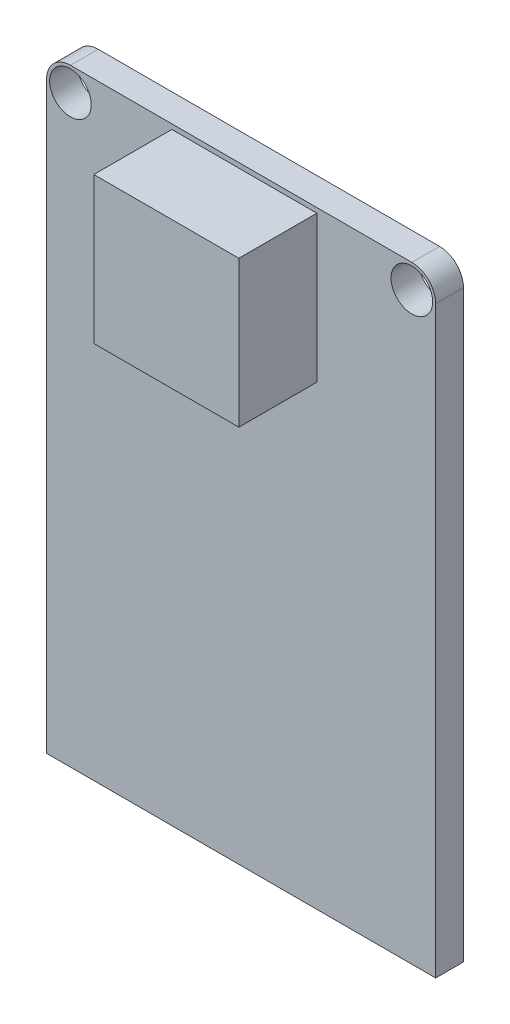
ISO-10303-21;
HEADER;
FILE_DESCRIPTION(('STEP AP214'),'2;1');
FILE_NAME('part.step','',(''),(''),'','','');
FILE_SCHEMA(('AUTOMOTIVE_DESIGN { 1 0 10303 214 1 1 1 1 }'));
ENDSEC;
DATA;
#1=APPLICATION_CONTEXT('core data for automotive mechanical design processes');
#2=APPLICATION_PROTOCOL_DEFINITION('international standard','automotive_design',2000,#1);
#3=PRODUCT_CONTEXT('',#1,'mechanical');
#4=PRODUCT('Part','Part','',(#3));
#5=PRODUCT_RELATED_PRODUCT_CATEGORY('part','',(#4));
#6=PRODUCT_DEFINITION_FORMATION('','',#4);
#7=PRODUCT_DEFINITION_CONTEXT('part definition',#1,'design');
#8=PRODUCT_DEFINITION('design','',#6,#7);
#9=PRODUCT_DEFINITION_SHAPE('','',#8);
#10=(LENGTH_UNIT() NAMED_UNIT(*) SI_UNIT(.MILLI.,.METRE.));
#11=(NAMED_UNIT(*) PLANE_ANGLE_UNIT() SI_UNIT($,.RADIAN.));
#12=(NAMED_UNIT(*) SI_UNIT($,.STERADIAN.) SOLID_ANGLE_UNIT());
#13=UNCERTAINTY_MEASURE_WITH_UNIT(LENGTH_MEASURE(1.E-05),#10,'distance_accuracy_value','');
#14=(GEOMETRIC_REPRESENTATION_CONTEXT(3) GLOBAL_UNCERTAINTY_ASSIGNED_CONTEXT((#13)) GLOBAL_UNIT_ASSIGNED_CONTEXT((#10,
#11,#12)) REPRESENTATION_CONTEXT('',''));
#15=CARTESIAN_POINT('',(0.,0.,0.));
#16=DIRECTION('',(0.,0.,1.));
#17=DIRECTION('',(1.,0.,0.));
#18=AXIS2_PLACEMENT_3D('',#15,#16,#17);
#19=CARTESIAN_POINT('',(-10.00125,16.4084,1.6256));
#20=DIRECTION('',(0.,0.,1.));
#21=DIRECTION('',(1.,0.,0.));
#22=AXIS2_PLACEMENT_3D('',#19,#20,#21);
#23=PLANE('',#22);
#24=CARTESIAN_POINT('',(-10.00125,16.4084,1.6256));
#25=DIRECTION('',(0.,0.,1.));
#26=DIRECTION('',(1.,0.,0.));
#27=AXIS2_PLACEMENT_3D('',#24,#25,#26);
#28=CIRCLE('',#27,1.21960350661836);
#29=CARTESIAN_POINT('',(-8.78164649338164,16.4084,1.6256));
#30=VERTEX_POINT('',#29);
#31=EDGE_CURVE('E140',#30,#30,#28,.T.);
#32=ORIENTED_EDGE('',*,*,#31,.F.);
#33=EDGE_LOOP('',(#32));
#34=FACE_BOUND('',#33,.T.);
#35=DIRECTION('',(0.,-1.,0.));
#36=VECTOR('',#35,1.);
#37=CARTESIAN_POINT('',(-11.39825,-17.8054,1.6256));
#38=LINE('',#37,#36);
#39=CARTESIAN_POINT('',(-11.39825,16.4084,1.6256));
#40=VERTEX_POINT('',#39);
#41=CARTESIAN_POINT('',(-11.39825,-17.8054,1.6256));
#42=VERTEX_POINT('',#41);
#43=EDGE_CURVE('E148',#40,#42,#38,.T.);
#44=ORIENTED_EDGE('',*,*,#43,.T.);
#45=DIRECTION('',(1.,0.,0.));
#46=VECTOR('',#45,1.);
#47=CARTESIAN_POINT('',(-11.39825,-17.8054,1.6256));
#48=LINE('',#47,#46);
#49=CARTESIAN_POINT('',(11.39825,-17.8054,1.6256));
#50=VERTEX_POINT('',#49);
#51=EDGE_CURVE('E98',#42,#50,#48,.T.);
#52=ORIENTED_EDGE('',*,*,#51,.T.);
#53=DIRECTION('',(0.,1.,0.));
#54=VECTOR('',#53,1.);
#55=CARTESIAN_POINT('',(11.39825,-17.8054,1.6256));
#56=LINE('',#55,#54);
#57=CARTESIAN_POINT('',(11.39825,16.4084,1.6256));
#58=VERTEX_POINT('',#57);
#59=EDGE_CURVE('E115',#50,#58,#56,.T.);
#60=ORIENTED_EDGE('',*,*,#59,.T.);
#61=CARTESIAN_POINT('',(10.00125,16.4084,1.6256));
#62=DIRECTION('',(0.,0.,1.));
#63=DIRECTION('',(1.,0.,0.));
#64=AXIS2_PLACEMENT_3D('',#61,#62,#63);
#65=CIRCLE('',#64,1.397);
#66=CARTESIAN_POINT('',(10.00125,17.8054,1.6256));
#67=VERTEX_POINT('',#66);
#68=EDGE_CURVE('E108',#58,#67,#65,.T.);
#69=ORIENTED_EDGE('',*,*,#68,.T.);
#70=DIRECTION('',(-1.,0.,0.));
#71=VECTOR('',#70,1.);
#72=CARTESIAN_POINT('',(-10.00125,17.8054,1.6256));
#73=LINE('',#72,#71);
#74=CARTESIAN_POINT('',(-10.00125,17.8054,1.6256));
#75=VERTEX_POINT('',#74);
#76=EDGE_CURVE('E112',#67,#75,#73,.T.);
#77=ORIENTED_EDGE('',*,*,#76,.T.);
#78=CARTESIAN_POINT('',(-10.00125,16.4084,1.6256));
#79=DIRECTION('',(0.,0.,1.));
#80=DIRECTION('',(1.,0.,0.));
#81=AXIS2_PLACEMENT_3D('',#78,#79,#80);
#82=CIRCLE('',#81,1.397);
#83=EDGE_CURVE('E63',#75,#40,#82,.T.);
#84=ORIENTED_EDGE('',*,*,#83,.T.);
#85=EDGE_LOOP('',(#44,#52,#60,#69,#77,#84));
#86=FACE_BOUND('',#85,.T.);
#87=CARTESIAN_POINT('',(10.00125,16.4084,1.6256));
#88=DIRECTION('',(0.,0.,1.));
#89=DIRECTION('',(1.,0.,0.));
#90=AXIS2_PLACEMENT_3D('',#87,#88,#89);
#91=CIRCLE('',#90,1.21960350661836);
#92=CARTESIAN_POINT('',(11.2208535066184,16.4084,1.6256));
#93=VERTEX_POINT('',#92);
#94=EDGE_CURVE('E169',#93,#93,#91,.T.);
#95=ORIENTED_EDGE('',*,*,#94,.F.);
#96=EDGE_LOOP('',(#95));
#97=FACE_BOUND('',#96,.T.);
#98=DIRECTION('',(-1.,0.,0.));
#99=VECTOR('',#98,1.);
#100=CARTESIAN_POINT('',(-4.05765,17.51965,1.6256));
#101=LINE('',#100,#99);
#102=CARTESIAN_POINT('',(4.43865,17.51965,1.6256));
#103=VERTEX_POINT('',#102);
#104=CARTESIAN_POINT('',(-4.05765,17.51965,1.6256));
#105=VERTEX_POINT('',#104);
#106=EDGE_CURVE('E193',#103,#105,#101,.T.);
#107=ORIENTED_EDGE('',*,*,#106,.F.);
#108=DIRECTION('',(0.,1.,0.));
#109=VECTOR('',#108,1.);
#110=CARTESIAN_POINT('',(4.43865,8.94715,1.6256));
#111=LINE('',#110,#109);
#112=CARTESIAN_POINT('',(4.43865,8.94715,1.6256));
#113=VERTEX_POINT('',#112);
#114=EDGE_CURVE('E196',#113,#103,#111,.T.);
#115=ORIENTED_EDGE('',*,*,#114,.F.);
#116=DIRECTION('',(1.,0.,0.));
#117=VECTOR('',#116,1.);
#118=CARTESIAN_POINT('',(-4.05765,8.94715,1.6256));
#119=LINE('',#118,#117);
#120=CARTESIAN_POINT('',(-4.05765,8.94715,1.6256));
#121=VERTEX_POINT('',#120);
#122=EDGE_CURVE('E188',#121,#113,#119,.T.);
#123=ORIENTED_EDGE('',*,*,#122,.F.);
#124=DIRECTION('',(0.,-1.,0.));
#125=VECTOR('',#124,1.);
#126=CARTESIAN_POINT('',(-4.05765,8.94715,1.6256));
#127=LINE('',#126,#125);
#128=EDGE_CURVE('E191',#105,#121,#127,.T.);
#129=ORIENTED_EDGE('',*,*,#128,.F.);
#130=EDGE_LOOP('',(#107,#115,#123,#129));
#131=FACE_BOUND('',#130,.T.);
#132=ADVANCED_FACE('F39',(#34,#86,#97,#131),#23,.T.);
#133=CARTESIAN_POINT('',(-10.00125,16.4084,0.));
#134=DIRECTION('',(0.,0.,1.));
#135=DIRECTION('',(1.,0.,0.));
#136=AXIS2_PLACEMENT_3D('',#133,#134,#135);
#137=PLANE('',#136);
#138=DIRECTION('',(0.,-1.,0.));
#139=VECTOR('',#138,1.);
#140=CARTESIAN_POINT('',(-11.39825,-17.8054,0.));
#141=LINE('',#140,#139);
#142=CARTESIAN_POINT('',(-11.39825,16.4084,0.));
#143=VERTEX_POINT('',#142);
#144=CARTESIAN_POINT('',(-11.39825,-17.8054,0.));
#145=VERTEX_POINT('',#144);
#146=EDGE_CURVE('E136',#143,#145,#141,.T.);
#147=ORIENTED_EDGE('',*,*,#146,.F.);
#148=CARTESIAN_POINT('',(-10.00125,16.4084,0.));
#149=DIRECTION('',(0.,0.,1.));
#150=DIRECTION('',(1.,0.,0.));
#151=AXIS2_PLACEMENT_3D('',#148,#149,#150);
#152=CIRCLE('',#151,1.397);
#153=CARTESIAN_POINT('',(-10.00125,17.8054,0.));
#154=VERTEX_POINT('',#153);
#155=EDGE_CURVE('E90',#154,#143,#152,.T.);
#156=ORIENTED_EDGE('',*,*,#155,.F.);
#157=DIRECTION('',(-1.,0.,0.));
#158=VECTOR('',#157,1.);
#159=CARTESIAN_POINT('',(-10.00125,17.8054,0.));
#160=LINE('',#159,#158);
#161=CARTESIAN_POINT('',(10.00125,17.8054,0.));
#162=VERTEX_POINT('',#161);
#163=EDGE_CURVE('E145',#162,#154,#160,.T.);
#164=ORIENTED_EDGE('',*,*,#163,.F.);
#165=CARTESIAN_POINT('',(10.00125,16.4084,0.));
#166=DIRECTION('',(0.,0.,1.));
#167=DIRECTION('',(1.,0.,0.));
#168=AXIS2_PLACEMENT_3D('',#165,#166,#167);
#169=CIRCLE('',#168,1.397);
#170=CARTESIAN_POINT('',(11.39825,16.4084,0.));
#171=VERTEX_POINT('',#170);
#172=EDGE_CURVE('E124',#171,#162,#169,.T.);
#173=ORIENTED_EDGE('',*,*,#172,.F.);
#174=DIRECTION('',(0.,1.,0.));
#175=VECTOR('',#174,1.);
#176=CARTESIAN_POINT('',(11.39825,-17.8054,0.));
#177=LINE('',#176,#175);
#178=CARTESIAN_POINT('',(11.39825,-17.8054,0.));
#179=VERTEX_POINT('',#178);
#180=EDGE_CURVE('E142',#179,#171,#177,.T.);
#181=ORIENTED_EDGE('',*,*,#180,.F.);
#182=DIRECTION('',(1.,0.,0.));
#183=VECTOR('',#182,1.);
#184=CARTESIAN_POINT('',(-11.39825,-17.8054,0.));
#185=LINE('',#184,#183);
#186=EDGE_CURVE('E139',#145,#179,#185,.T.);
#187=ORIENTED_EDGE('',*,*,#186,.F.);
#188=EDGE_LOOP('',(#147,#156,#164,#173,#181,#187));
#189=FACE_BOUND('',#188,.T.);
#190=CARTESIAN_POINT('',(-10.00125,16.4084,0.));
#191=DIRECTION('',(0.,0.,1.));
#192=DIRECTION('',(1.,0.,0.));
#193=AXIS2_PLACEMENT_3D('',#190,#191,#192);
#194=CIRCLE('',#193,1.21960350661836);
#195=CARTESIAN_POINT('',(-8.78164649338164,16.4084,0.));
#196=VERTEX_POINT('',#195);
#197=EDGE_CURVE('E166',#196,#196,#194,.T.);
#198=ORIENTED_EDGE('',*,*,#197,.T.);
#199=EDGE_LOOP('',(#198));
#200=FACE_BOUND('',#199,.T.);
#201=CARTESIAN_POINT('',(10.00125,16.4084,0.));
#202=DIRECTION('',(0.,0.,1.));
#203=DIRECTION('',(1.,0.,0.));
#204=AXIS2_PLACEMENT_3D('',#201,#202,#203);
#205=CIRCLE('',#204,1.21960350661836);
#206=CARTESIAN_POINT('',(11.2208535066184,16.4084,0.));
#207=VERTEX_POINT('',#206);
#208=EDGE_CURVE('E172',#207,#207,#205,.T.);
#209=ORIENTED_EDGE('',*,*,#208,.T.);
#210=EDGE_LOOP('',(#209));
#211=FACE_BOUND('',#210,.T.);
#212=ADVANCED_FACE('F157',(#189,#200,#211),#137,.F.);
#213=CARTESIAN_POINT('',(-11.39825,-17.8054,1.6256));
#214=DIRECTION('',(1.,0.,0.));
#215=DIRECTION('',(0.,0.,-1.));
#216=AXIS2_PLACEMENT_3D('',#213,#214,#215);
#217=PLANE('',#216);
#218=ORIENTED_EDGE('',*,*,#146,.T.);
#219=DIRECTION('',(0.,0.,-1.));
#220=VECTOR('',#219,1.);
#221=CARTESIAN_POINT('',(-11.39825,-17.8054,1.6256));
#222=LINE('',#221,#220);
#223=EDGE_CURVE('E11',#42,#145,#222,.T.);
#224=ORIENTED_EDGE('',*,*,#223,.F.);
#225=ORIENTED_EDGE('',*,*,#43,.F.);
#226=DIRECTION('',(0.,0.,-1.));
#227=VECTOR('',#226,1.);
#228=CARTESIAN_POINT('',(-11.39825,16.4084,1.6256));
#229=LINE('',#228,#227);
#230=EDGE_CURVE('E132',#40,#143,#229,.T.);
#231=ORIENTED_EDGE('',*,*,#230,.T.);
#232=EDGE_LOOP('',(#218,#224,#225,#231));
#233=FACE_BOUND('',#232,.T.);
#234=ADVANCED_FACE('F41',(#233),#217,.F.);
#235=CARTESIAN_POINT('',(-11.39825,-17.8054,1.6256));
#236=DIRECTION('',(0.,1.,0.));
#237=DIRECTION('',(0.,0.,1.));
#238=AXIS2_PLACEMENT_3D('',#235,#236,#237);
#239=PLANE('',#238);
#240=ORIENTED_EDGE('',*,*,#186,.T.);
#241=DIRECTION('',(0.,0.,-1.));
#242=VECTOR('',#241,1.);
#243=CARTESIAN_POINT('',(11.39825,-17.8054,1.6256));
#244=LINE('',#243,#242);
#245=EDGE_CURVE('E47',#50,#179,#244,.T.);
#246=ORIENTED_EDGE('',*,*,#245,.F.);
#247=ORIENTED_EDGE('',*,*,#51,.F.);
#248=ORIENTED_EDGE('',*,*,#223,.T.);
#249=EDGE_LOOP('',(#240,#246,#247,#248));
#250=FACE_BOUND('',#249,.T.);
#251=ADVANCED_FACE('F259',(#250),#239,.F.);
#252=CARTESIAN_POINT('',(11.39825,-17.8054,1.6256));
#253=DIRECTION('',(-1.,0.,0.));
#254=DIRECTION('',(0.,0.,1.));
#255=AXIS2_PLACEMENT_3D('',#252,#253,#254);
#256=PLANE('',#255);
#257=ORIENTED_EDGE('',*,*,#180,.T.);
#258=DIRECTION('',(0.,0.,-1.));
#259=VECTOR('',#258,1.);
#260=CARTESIAN_POINT('',(11.39825,16.4084,1.6256));
#261=LINE('',#260,#259);
#262=EDGE_CURVE('E127',#58,#171,#261,.T.);
#263=ORIENTED_EDGE('',*,*,#262,.F.);
#264=ORIENTED_EDGE('',*,*,#59,.F.);
#265=ORIENTED_EDGE('',*,*,#245,.T.);
#266=EDGE_LOOP('',(#257,#263,#264,#265));
#267=FACE_BOUND('',#266,.T.);
#268=ADVANCED_FACE('F154',(#267),#256,.F.);
#269=CARTESIAN_POINT('',(10.00125,16.4084,1.6256));
#270=DIRECTION('',(0.,0.,-1.));
#271=DIRECTION('',(-1.,0.,0.));
#272=AXIS2_PLACEMENT_3D('',#269,#270,#271);
#273=CYLINDRICAL_SURFACE('',#272,1.397);
#274=ORIENTED_EDGE('',*,*,#172,.T.);
#275=DIRECTION('',(0.,0.,-1.));
#276=VECTOR('',#275,1.);
#277=CARTESIAN_POINT('',(10.00125,17.8054,1.6256));
#278=LINE('',#277,#276);
#279=EDGE_CURVE('E121',#67,#162,#278,.T.);
#280=ORIENTED_EDGE('',*,*,#279,.F.);
#281=ORIENTED_EDGE('',*,*,#68,.F.);
#282=ORIENTED_EDGE('',*,*,#262,.T.);
#283=EDGE_LOOP('',(#274,#280,#281,#282));
#284=FACE_BOUND('',#283,.T.);
#285=ADVANCED_FACE('F122',(#284),#273,.T.);
#286=CARTESIAN_POINT('',(-10.00125,17.8054,1.6256));
#287=DIRECTION('',(0.,-1.,0.));
#288=DIRECTION('',(0.,0.,-1.));
#289=AXIS2_PLACEMENT_3D('',#286,#287,#288);
#290=PLANE('',#289);
#291=ORIENTED_EDGE('',*,*,#163,.T.);
#292=DIRECTION('',(0.,0.,-1.));
#293=VECTOR('',#292,1.);
#294=CARTESIAN_POINT('',(-10.00125,17.8054,1.6256));
#295=LINE('',#294,#293);
#296=EDGE_CURVE('E128',#75,#154,#295,.T.);
#297=ORIENTED_EDGE('',*,*,#296,.F.);
#298=ORIENTED_EDGE('',*,*,#76,.F.);
#299=ORIENTED_EDGE('',*,*,#279,.T.);
#300=EDGE_LOOP('',(#291,#297,#298,#299));
#301=FACE_BOUND('',#300,.T.);
#302=ADVANCED_FACE('F130',(#301),#290,.F.);
#303=CARTESIAN_POINT('',(-10.00125,16.4084,1.6256));
#304=DIRECTION('',(0.,0.,-1.));
#305=DIRECTION('',(-1.,0.,0.));
#306=AXIS2_PLACEMENT_3D('',#303,#304,#305);
#307=CYLINDRICAL_SURFACE('',#306,1.397);
#308=ORIENTED_EDGE('',*,*,#155,.T.);
#309=ORIENTED_EDGE('',*,*,#230,.F.);
#310=ORIENTED_EDGE('',*,*,#83,.F.);
#311=ORIENTED_EDGE('',*,*,#296,.T.);
#312=EDGE_LOOP('',(#308,#309,#310,#311));
#313=FACE_BOUND('',#312,.T.);
#314=ADVANCED_FACE('F159',(#313),#307,.T.);
#315=CARTESIAN_POINT('',(-10.00125,16.4084,1.6256));
#316=DIRECTION('',(0.,0.,-1.));
#317=DIRECTION('',(-1.,0.,0.));
#318=AXIS2_PLACEMENT_3D('',#315,#316,#317);
#319=CYLINDRICAL_SURFACE('',#318,1.21960350661836);
#320=ORIENTED_EDGE('',*,*,#31,.T.);
#321=EDGE_LOOP('',(#320));
#322=FACE_BOUND('',#321,.T.);
#323=ORIENTED_EDGE('',*,*,#197,.F.);
#324=EDGE_LOOP('',(#323));
#325=FACE_BOUND('',#324,.T.);
#326=ADVANCED_FACE('F249',(#322,#325),#319,.F.);
#327=CARTESIAN_POINT('',(10.00125,16.4084,1.6256));
#328=DIRECTION('',(0.,0.,-1.));
#329=DIRECTION('',(-1.,0.,0.));
#330=AXIS2_PLACEMENT_3D('',#327,#328,#329);
#331=CYLINDRICAL_SURFACE('',#330,1.21960350661836);
#332=ORIENTED_EDGE('',*,*,#94,.T.);
#333=EDGE_LOOP('',(#332));
#334=FACE_BOUND('',#333,.T.);
#335=ORIENTED_EDGE('',*,*,#208,.F.);
#336=EDGE_LOOP('',(#335));
#337=FACE_BOUND('',#336,.T.);
#338=ADVANCED_FACE('F305',(#334,#337),#331,.F.);
#339=CARTESIAN_POINT('',(4.43865,8.94715,6.1976));
#340=DIRECTION('',(-1.,0.,0.));
#341=DIRECTION('',(0.,0.,1.));
#342=AXIS2_PLACEMENT_3D('',#339,#340,#341);
#343=PLANE('',#342);
#344=ORIENTED_EDGE('',*,*,#114,.T.);
#345=DIRECTION('',(0.,0.,-1.));
#346=VECTOR('',#345,1.);
#347=CARTESIAN_POINT('',(4.43865,17.51965,6.1976));
#348=LINE('',#347,#346);
#349=CARTESIAN_POINT('',(4.43865,17.51965,6.1976));
#350=VERTEX_POINT('',#349);
#351=EDGE_CURVE('E175',#350,#103,#348,.T.);
#352=ORIENTED_EDGE('',*,*,#351,.F.);
#353=DIRECTION('',(0.,1.,0.));
#354=VECTOR('',#353,1.);
#355=CARTESIAN_POINT('',(4.43865,8.94715,6.1976));
#356=LINE('',#355,#354);
#357=CARTESIAN_POINT('',(4.43865,8.94715,6.1976));
#358=VERTEX_POINT('',#357);
#359=EDGE_CURVE('E190',#358,#350,#356,.T.);
#360=ORIENTED_EDGE('',*,*,#359,.F.);
#361=DIRECTION('',(0.,0.,-1.));
#362=VECTOR('',#361,1.);
#363=CARTESIAN_POINT('',(4.43865,8.94715,6.1976));
#364=LINE('',#363,#362);
#365=EDGE_CURVE('E184',#358,#113,#364,.T.);
#366=ORIENTED_EDGE('',*,*,#365,.T.);
#367=EDGE_LOOP('',(#344,#352,#360,#366));
#368=FACE_BOUND('',#367,.T.);
#369=ADVANCED_FACE('F219',(#368),#343,.F.);
#370=CARTESIAN_POINT('',(-4.05765,17.51965,6.1976));
#371=DIRECTION('',(0.,-1.,0.));
#372=DIRECTION('',(0.,0.,-1.));
#373=AXIS2_PLACEMENT_3D('',#370,#371,#372);
#374=PLANE('',#373);
#375=ORIENTED_EDGE('',*,*,#106,.T.);
#376=DIRECTION('',(0.,0.,-1.));
#377=VECTOR('',#376,1.);
#378=CARTESIAN_POINT('',(-4.05765,17.51965,6.1976));
#379=LINE('',#378,#377);
#380=CARTESIAN_POINT('',(-4.05765,17.51965,6.1976));
#381=VERTEX_POINT('',#380);
#382=EDGE_CURVE('E180',#381,#105,#379,.T.);
#383=ORIENTED_EDGE('',*,*,#382,.F.);
#384=DIRECTION('',(-1.,0.,0.));
#385=VECTOR('',#384,1.);
#386=CARTESIAN_POINT('',(-4.05765,17.51965,6.1976));
#387=LINE('',#386,#385);
#388=EDGE_CURVE('E204',#350,#381,#387,.T.);
#389=ORIENTED_EDGE('',*,*,#388,.F.);
#390=ORIENTED_EDGE('',*,*,#351,.T.);
#391=EDGE_LOOP('',(#375,#383,#389,#390));
#392=FACE_BOUND('',#391,.T.);
#393=ADVANCED_FACE('F224',(#392),#374,.F.);
#394=CARTESIAN_POINT('',(-4.05765,8.94715,6.1976));
#395=DIRECTION('',(1.,0.,0.));
#396=DIRECTION('',(0.,0.,-1.));
#397=AXIS2_PLACEMENT_3D('',#394,#395,#396);
#398=PLANE('',#397);
#399=ORIENTED_EDGE('',*,*,#128,.T.);
#400=DIRECTION('',(0.,0.,-1.));
#401=VECTOR('',#400,1.);
#402=CARTESIAN_POINT('',(-4.05765,8.94715,6.1976));
#403=LINE('',#402,#401);
#404=CARTESIAN_POINT('',(-4.05765,8.94715,6.1976));
#405=VERTEX_POINT('',#404);
#406=EDGE_CURVE('E54',#405,#121,#403,.T.);
#407=ORIENTED_EDGE('',*,*,#406,.F.);
#408=DIRECTION('',(0.,-1.,0.));
#409=VECTOR('',#408,1.);
#410=CARTESIAN_POINT('',(-4.05765,8.94715,6.1976));
#411=LINE('',#410,#409);
#412=EDGE_CURVE('E201',#381,#405,#411,.T.);
#413=ORIENTED_EDGE('',*,*,#412,.F.);
#414=ORIENTED_EDGE('',*,*,#382,.T.);
#415=EDGE_LOOP('',(#399,#407,#413,#414));
#416=FACE_BOUND('',#415,.T.);
#417=ADVANCED_FACE('F233',(#416),#398,.F.);
#418=CARTESIAN_POINT('',(-4.05765,8.94715,6.1976));
#419=DIRECTION('',(0.,1.,0.));
#420=DIRECTION('',(0.,0.,1.));
#421=AXIS2_PLACEMENT_3D('',#418,#419,#420);
#422=PLANE('',#421);
#423=ORIENTED_EDGE('',*,*,#122,.T.);
#424=ORIENTED_EDGE('',*,*,#365,.F.);
#425=DIRECTION('',(1.,0.,0.));
#426=VECTOR('',#425,1.);
#427=CARTESIAN_POINT('',(-4.05765,8.94715,6.1976));
#428=LINE('',#427,#426);
#429=EDGE_CURVE('E187',#405,#358,#428,.T.);
#430=ORIENTED_EDGE('',*,*,#429,.F.);
#431=ORIENTED_EDGE('',*,*,#406,.T.);
#432=EDGE_LOOP('',(#423,#424,#430,#431));
#433=FACE_BOUND('',#432,.T.);
#434=ADVANCED_FACE('F236',(#433),#422,.F.);
#435=CARTESIAN_POINT('',(0.,0.,6.1976));
#436=DIRECTION('',(0.,0.,-1.));
#437=DIRECTION('',(-1.,0.,0.));
#438=AXIS2_PLACEMENT_3D('',#435,#436,#437);
#439=PLANE('',#438);
#440=ORIENTED_EDGE('',*,*,#359,.T.);
#441=ORIENTED_EDGE('',*,*,#388,.T.);
#442=ORIENTED_EDGE('',*,*,#412,.T.);
#443=ORIENTED_EDGE('',*,*,#429,.T.);
#444=EDGE_LOOP('',(#440,#441,#442,#443));
#445=FACE_BOUND('',#444,.T.);
#446=ADVANCED_FACE('F212',(#445),#439,.F.);
#447=CLOSED_SHELL('',(#132,#212,#234,#251,#268,#285,#302,#314,#326,#338,#369,#393,#417,#434,#446));
#448=MANIFOLD_SOLID_BREP('B2',#447);
#449=ADVANCED_BREP_SHAPE_REPRESENTATION('',(#18,#448),#14);
#450=SHAPE_DEFINITION_REPRESENTATION(#9,#449);
ENDSEC;
END-ISO-10303-21;
